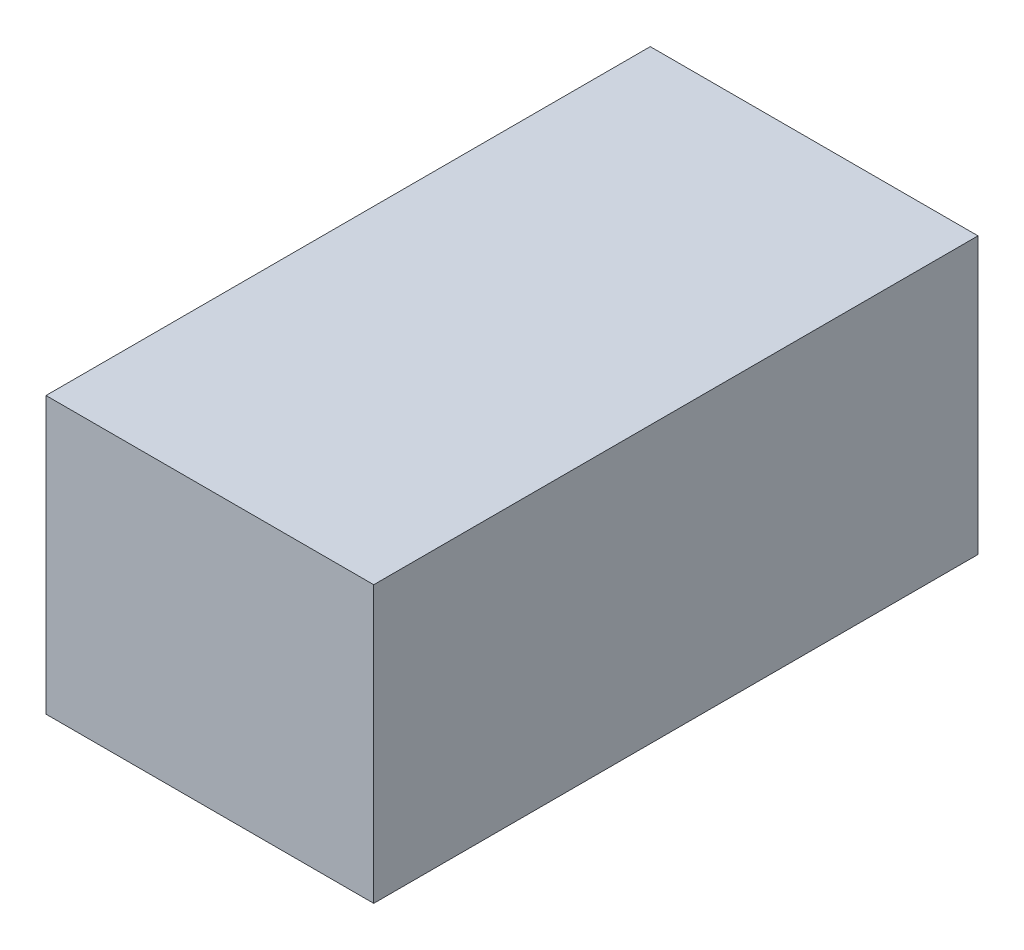
ISO-10303-21;
HEADER;
FILE_DESCRIPTION(('STEP AP214'),'2;1');
FILE_NAME('part.step','',(''),(''),'','','');
FILE_SCHEMA(('AUTOMOTIVE_DESIGN { 1 0 10303 214 1 1 1 1 }'));
ENDSEC;
DATA;
#1=APPLICATION_CONTEXT('core data for automotive mechanical design processes');
#2=APPLICATION_PROTOCOL_DEFINITION('international standard','automotive_design',2000,#1);
#3=PRODUCT_CONTEXT('',#1,'mechanical');
#4=PRODUCT('Part','Part','',(#3));
#5=PRODUCT_RELATED_PRODUCT_CATEGORY('part','',(#4));
#6=PRODUCT_DEFINITION_FORMATION('','',#4);
#7=PRODUCT_DEFINITION_CONTEXT('part definition',#1,'design');
#8=PRODUCT_DEFINITION('design','',#6,#7);
#9=PRODUCT_DEFINITION_SHAPE('','',#8);
#10=(LENGTH_UNIT() NAMED_UNIT(*) SI_UNIT(.MILLI.,.METRE.));
#11=(NAMED_UNIT(*) PLANE_ANGLE_UNIT() SI_UNIT($,.RADIAN.));
#12=(NAMED_UNIT(*) SI_UNIT($,.STERADIAN.) SOLID_ANGLE_UNIT());
#13=UNCERTAINTY_MEASURE_WITH_UNIT(LENGTH_MEASURE(1.E-05),#10,'distance_accuracy_value','');
#14=(GEOMETRIC_REPRESENTATION_CONTEXT(3) GLOBAL_UNCERTAINTY_ASSIGNED_CONTEXT((#13)) GLOBAL_UNIT_ASSIGNED_CONTEXT((#10,
#11,#12)) REPRESENTATION_CONTEXT('',''));
#15=CARTESIAN_POINT('',(0.,0.,0.));
#16=DIRECTION('',(0.,0.,1.));
#17=DIRECTION('',(1.,0.,0.));
#18=AXIS2_PLACEMENT_3D('',#15,#16,#17);
#19=CARTESIAN_POINT('',(-72.39500445779,-1.541385122797,-47.2486397349));
#20=DIRECTION('',(0.,1.,0.));
#21=DIRECTION('',(0.,0.,1.));
#22=AXIS2_PLACEMENT_3D('',#19,#20,#21);
#23=PLANE('',#22);
#24=DIRECTION('',(0.,0.,1.));
#25=VECTOR('',#24,1.);
#26=CARTESIAN_POINT('',(-75.24500355974,-1.541385122797,-47.78847959913));
#27=LINE('',#26,#25);
#28=CARTESIAN_POINT('',(-75.24500395264,-1.541385122797,-47.0733197376422));
#29=VERTEX_POINT('',#28);
#30=CARTESIAN_POINT('',(-75.245004064895,-1.5413851384375,-47.4236397301122));
#31=VERTEX_POINT('',#30);
#32=EDGE_CURVE('E19',#29,#31,#27,.F.);
#33=ORIENTED_EDGE('',*,*,#32,.F.);
#34=DIRECTION('',(1.,0.,0.));
#35=VECTOR('',#34,1.);
#36=CARTESIAN_POINT('',(-73.12019237886,-1.541385122797,-47.0733197376487));
#37=LINE('',#36,#35);
#38=CARTESIAN_POINT('',(-75.05500447043,-1.541385122797,-47.0733197376443));
#39=VERTEX_POINT('',#38);
#40=EDGE_CURVE('E54',#39,#29,#37,.F.);
#41=ORIENTED_EDGE('',*,*,#40,.F.);
#42=DIRECTION('',(0.,0.,1.));
#43=VECTOR('',#42,1.);
#44=CARTESIAN_POINT('',(-75.05500447043,-1.541385122797,-47.24863973798));
#45=LINE('',#44,#43);
#46=CARTESIAN_POINT('',(-75.0550044713,-1.5413851384375,-47.4236397294272));
#47=VERTEX_POINT('',#46);
#48=EDGE_CURVE('E73',#39,#47,#45,.F.);
#49=ORIENTED_EDGE('',*,*,#48,.T.);
#50=DIRECTION('',(1.,0.,0.));
#51=VECTOR('',#50,1.);
#52=CARTESIAN_POINT('',(-74.98500392881,-1.541385185359,-47.4236397376387));
#53=LINE('',#52,#51);
#54=EDGE_CURVE('E65',#31,#47,#53,.T.);
#55=ORIENTED_EDGE('',*,*,#54,.F.);
#56=EDGE_LOOP('',(#33,#41,#49,#55));
#57=FACE_BOUND('',#56,.T.);
#58=ADVANCED_FACE('F16',(#57),#23,.T.);
#59=CARTESIAN_POINT('',(-75.24500355974,-2.053616807094,-47.78847959913));
#60=DIRECTION('',(-1.,0.,0.));
#61=DIRECTION('',(0.,0.,1.));
#62=AXIS2_PLACEMENT_3D('',#59,#60,#61);
#63=PLANE('',#62);
#64=DIRECTION('',(0.,0.,1.));
#65=VECTOR('',#64,1.);
#66=CARTESIAN_POINT('',(-75.24500423328,-1.701384399524,-44.44597974038));
#67=LINE('',#66,#65);
#68=CARTESIAN_POINT('',(-75.24500389651,-1.701384409809,-47.4236397317096));
#69=VERTEX_POINT('',#68);
#70=CARTESIAN_POINT('',(-75.245003784255,-1.70138440791425,-47.0733197376421));
#71=VERTEX_POINT('',#70);
#72=EDGE_CURVE('E71',#69,#71,#67,.T.);
#73=ORIENTED_EDGE('',*,*,#72,.T.);
#74=DIRECTION('',(0.,-1.,1.798143292204E-12));
#75=VECTOR('',#74,1.);
#76=CARTESIAN_POINT('',(-75.24500378426,-0.806384399451,-47.07331973765));
#77=LINE('',#76,#75);
#78=EDGE_CURVE('E61',#29,#71,#77,.T.);
#79=ORIENTED_EDGE('',*,*,#78,.F.);
#80=ORIENTED_EDGE('',*,*,#32,.T.);
#81=DIRECTION('',(0.,1.,-1.798143292204E-12));
#82=VECTOR('',#81,1.);
#83=CARTESIAN_POINT('',(-75.24500423328,-0.806384399449,-47.42363973764));
#84=LINE('',#83,#82);
#85=EDGE_CURVE('E79',#69,#31,#84,.T.);
#86=ORIENTED_EDGE('',*,*,#85,.F.);
#87=EDGE_LOOP('',(#73,#79,#80,#86));
#88=FACE_BOUND('',#87,.T.);
#89=ADVANCED_FACE('F70',(#88),#63,.T.);
#90=CARTESIAN_POINT('',(-73.12019237886,-0.806384399451,-47.07331973765));
#91=DIRECTION('',(0.,1.798143292204E-12,1.));
#92=DIRECTION('',(0.,-1.,1.798143292204E-12));
#93=AXIS2_PLACEMENT_3D('',#90,#91,#92);
#94=PLANE('',#93);
#95=DIRECTION('',(1.,0.,0.));
#96=VECTOR('',#95,1.);
#97=CARTESIAN_POINT('',(-72.39499368142,-1.701384399524,-47.07331973764));
#98=LINE('',#97,#96);
#99=CARTESIAN_POINT('',(-75.05500447043,-1.7013844054785,-47.0733197376442));
#100=VERTEX_POINT('',#99);
#101=EDGE_CURVE('E82',#71,#100,#98,.T.);
#102=ORIENTED_EDGE('',*,*,#101,.T.);
#103=DIRECTION('',(0.,1.,0.));
#104=VECTOR('',#103,1.);
#105=CARTESIAN_POINT('',(-75.05500447043,-1.691385382543,-47.07331973764));
#106=LINE('',#105,#104);
#107=EDGE_CURVE('E63',#100,#39,#106,.T.);
#108=ORIENTED_EDGE('',*,*,#107,.T.);
#109=ORIENTED_EDGE('',*,*,#40,.T.);
#110=ORIENTED_EDGE('',*,*,#78,.T.);
#111=EDGE_LOOP('',(#102,#108,#109,#110));
#112=FACE_BOUND('',#111,.T.);
#113=ADVANCED_FACE('F59',(#112),#94,.T.);
#114=CARTESIAN_POINT('',(-75.05500447043,-1.691385382543,-47.24863973798));
#115=DIRECTION('',(-1.,0.,0.));
#116=DIRECTION('',(0.,0.,1.));
#117=AXIS2_PLACEMENT_3D('',#114,#115,#116);
#118=PLANE('',#117);
#119=DIRECTION('',(0.,1.,-1.798143292204E-12));
#120=VECTOR('',#119,1.);
#121=CARTESIAN_POINT('',(-75.05500447391,-0.806384399449,-47.42363973764));
#122=LINE('',#121,#120);
#123=CARTESIAN_POINT('',(-75.0550044713,-1.701384409268,-47.4236397303396));
#124=VERTEX_POINT('',#123);
#125=EDGE_CURVE('E33',#47,#124,#122,.F.);
#126=ORIENTED_EDGE('',*,*,#125,.F.);
#127=ORIENTED_EDGE('',*,*,#48,.F.);
#128=ORIENTED_EDGE('',*,*,#107,.F.);
#129=DIRECTION('',(0.,0.,1.));
#130=VECTOR('',#129,1.);
#131=CARTESIAN_POINT('',(-75.05500447043,-1.701384399524,-44.44597974038));
#132=LINE('',#131,#130);
#133=EDGE_CURVE('E25',#100,#124,#132,.F.);
#134=ORIENTED_EDGE('',*,*,#133,.T.);
#135=EDGE_LOOP('',(#126,#127,#128,#134));
#136=FACE_BOUND('',#135,.T.);
#137=ADVANCED_FACE('F87',(#136),#118,.F.);
#138=CARTESIAN_POINT('',(-74.98500392881,-0.806384399449,-47.42363973764));
#139=DIRECTION('',(0.,-1.798143292204E-12,-1.));
#140=DIRECTION('',(0.,1.,-1.798143292204E-12));
#141=AXIS2_PLACEMENT_3D('',#138,#139,#140);
#142=PLANE('',#141);
#143=DIRECTION('',(1.,0.,0.));
#144=VECTOR('',#143,1.);
#145=CARTESIAN_POINT('',(-72.39499368142,-1.701384399524,-47.42363973034));
#146=LINE('',#145,#144);
#147=EDGE_CURVE('E11',#124,#69,#146,.F.);
#148=ORIENTED_EDGE('',*,*,#147,.T.);
#149=ORIENTED_EDGE('',*,*,#85,.T.);
#150=ORIENTED_EDGE('',*,*,#54,.T.);
#151=ORIENTED_EDGE('',*,*,#125,.T.);
#152=EDGE_LOOP('',(#148,#149,#150,#151));
#153=FACE_BOUND('',#152,.T.);
#154=ADVANCED_FACE('F90',(#153),#142,.T.);
#155=CARTESIAN_POINT('',(-72.39499368142,-1.701384399524,-44.44597974038));
#156=DIRECTION('',(0.,1.,0.));
#157=DIRECTION('',(0.,0.,1.));
#158=AXIS2_PLACEMENT_3D('',#155,#156,#157);
#159=PLANE('',#158);
#160=ORIENTED_EDGE('',*,*,#133,.F.);
#161=ORIENTED_EDGE('',*,*,#101,.F.);
#162=ORIENTED_EDGE('',*,*,#72,.F.);
#163=ORIENTED_EDGE('',*,*,#147,.F.);
#164=EDGE_LOOP('',(#160,#161,#162,#163));
#165=FACE_BOUND('',#164,.T.);
#166=ADVANCED_FACE('F89',(#165),#159,.F.);
#167=CLOSED_SHELL('',(#58,#89,#113,#137,#154,#166));
#168=MANIFOLD_SOLID_BREP('B1',#167);
#169=ADVANCED_BREP_SHAPE_REPRESENTATION('',(#18,#168),#14);
#170=SHAPE_DEFINITION_REPRESENTATION(#9,#169);
ENDSEC;
END-ISO-10303-21;
